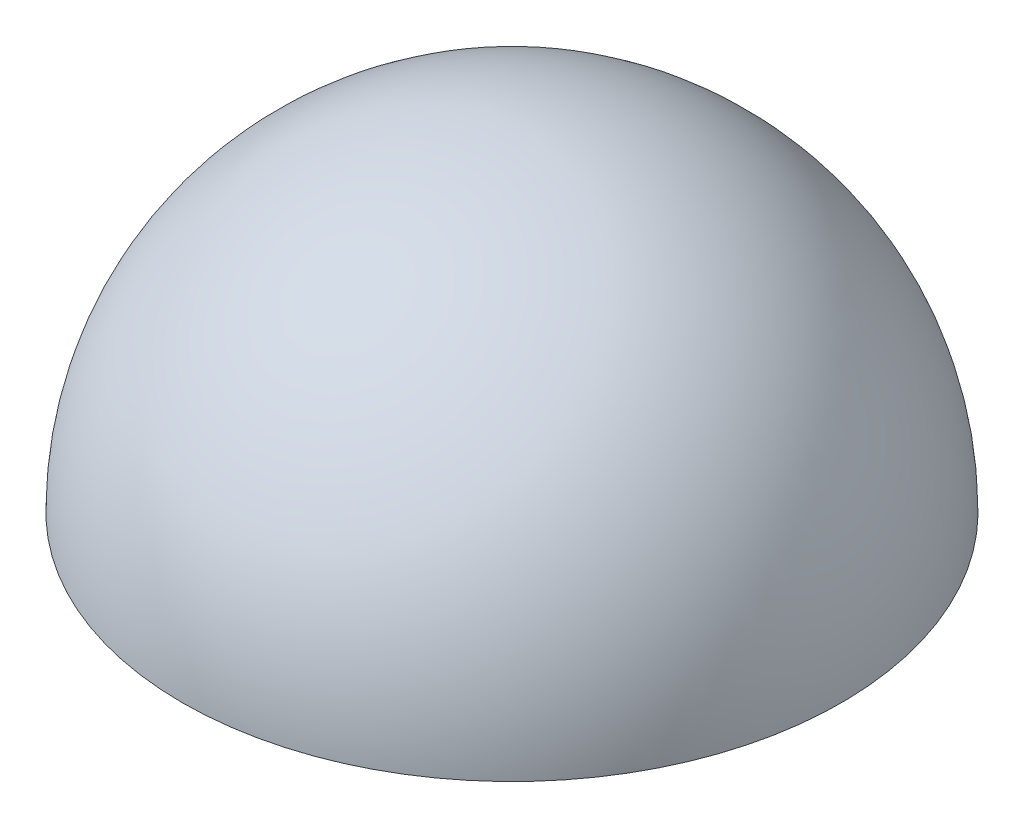
ISO-10303-21;
HEADER;
FILE_DESCRIPTION(('STEP AP214'),'2;1');
FILE_NAME('part.step','',(''),(''),'','','');
FILE_SCHEMA(('AUTOMOTIVE_DESIGN { 1 0 10303 214 1 1 1 1 }'));
ENDSEC;
DATA;
#1=APPLICATION_CONTEXT('core data for automotive mechanical design processes');
#2=APPLICATION_PROTOCOL_DEFINITION('international standard','automotive_design',2000,#1);
#3=PRODUCT_CONTEXT('',#1,'mechanical');
#4=PRODUCT('Part','Part','',(#3));
#5=PRODUCT_RELATED_PRODUCT_CATEGORY('part','',(#4));
#6=PRODUCT_DEFINITION_FORMATION('','',#4);
#7=PRODUCT_DEFINITION_CONTEXT('part definition',#1,'design');
#8=PRODUCT_DEFINITION('design','',#6,#7);
#9=PRODUCT_DEFINITION_SHAPE('','',#8);
#10=(LENGTH_UNIT() NAMED_UNIT(*) SI_UNIT(.MILLI.,.METRE.));
#11=(NAMED_UNIT(*) PLANE_ANGLE_UNIT() SI_UNIT($,.RADIAN.));
#12=(NAMED_UNIT(*) SI_UNIT($,.STERADIAN.) SOLID_ANGLE_UNIT());
#13=UNCERTAINTY_MEASURE_WITH_UNIT(LENGTH_MEASURE(1.E-05),#10,'distance_accuracy_value','');
#14=(GEOMETRIC_REPRESENTATION_CONTEXT(3) GLOBAL_UNCERTAINTY_ASSIGNED_CONTEXT((#13)) GLOBAL_UNIT_ASSIGNED_CONTEXT((#10,
#11,#12)) REPRESENTATION_CONTEXT('',''));
#15=CARTESIAN_POINT('',(0.,0.,0.));
#16=DIRECTION('',(0.,0.,1.));
#17=DIRECTION('',(1.,0.,0.));
#18=AXIS2_PLACEMENT_3D('',#15,#16,#17);
#19=CARTESIAN_POINT('',(0.,0.,0.));
#20=DIRECTION('',(0.,-1.,0.));
#21=DIRECTION('',(0.,0.,-1.));
#22=AXIS2_PLACEMENT_3D('',#19,#20,#21);
#23=PLANE('',#22);
#24=CARTESIAN_POINT('',(0.,0.,0.));
#25=DIRECTION('',(0.,1.,0.));
#26=DIRECTION('',(0.,0.,1.));
#27=AXIS2_PLACEMENT_3D('',#24,#25,#26);
#28=CIRCLE('',#27,19.6);
#29=CARTESIAN_POINT('',(0.,0.,19.6));
#30=VERTEX_POINT('',#29);
#31=EDGE_CURVE('E39',#30,#30,#28,.T.);
#32=ORIENTED_EDGE('',*,*,#31,.T.);
#33=EDGE_LOOP('',(#32));
#34=FACE_BOUND('',#33,.T.);
#35=CARTESIAN_POINT('',(0.,0.,0.));
#36=DIRECTION('',(0.,1.,0.));
#37=DIRECTION('',(0.,0.,1.));
#38=AXIS2_PLACEMENT_3D('',#35,#36,#37);
#39=CIRCLE('',#38,20.);
#40=CARTESIAN_POINT('',(0.,0.,20.));
#41=VERTEX_POINT('',#40);
#42=EDGE_CURVE('E10',#41,#41,#39,.T.);
#43=ORIENTED_EDGE('',*,*,#42,.F.);
#44=EDGE_LOOP('',(#43));
#45=FACE_BOUND('',#44,.T.);
#46=ADVANCED_FACE('F33',(#34,#45),#23,.T.);
#47=CARTESIAN_POINT('',(0.,0.,0.));
#48=DIRECTION('',(0.,1.,0.));
#49=DIRECTION('',(0.,0.,1.));
#50=AXIS2_PLACEMENT_3D('',#47,#48,#49);
#51=SPHERICAL_SURFACE('',#50,20.);
#52=ORIENTED_EDGE('',*,*,#42,.T.);
#53=EDGE_LOOP('',(#52));
#54=FACE_BOUND('',#53,.T.);
#55=ADVANCED_FACE('F49',(#54),#51,.T.);
#56=CARTESIAN_POINT('',(0.,0.,0.));
#57=DIRECTION('',(0.,1.,0.));
#58=DIRECTION('',(0.,0.,1.));
#59=AXIS2_PLACEMENT_3D('',#56,#57,#58);
#60=SPHERICAL_SURFACE('',#59,19.6);
#61=ORIENTED_EDGE('',*,*,#31,.F.);
#62=EDGE_LOOP('',(#61));
#63=FACE_BOUND('',#62,.T.);
#64=ADVANCED_FACE('F47',(#63),#60,.F.);
#65=CLOSED_SHELL('',(#46,#55,#64));
#66=MANIFOLD_SOLID_BREP('B2',#65);
#67=ADVANCED_BREP_SHAPE_REPRESENTATION('',(#18,#66),#14);
#68=SHAPE_DEFINITION_REPRESENTATION(#9,#67);
ENDSEC;
END-ISO-10303-21;
